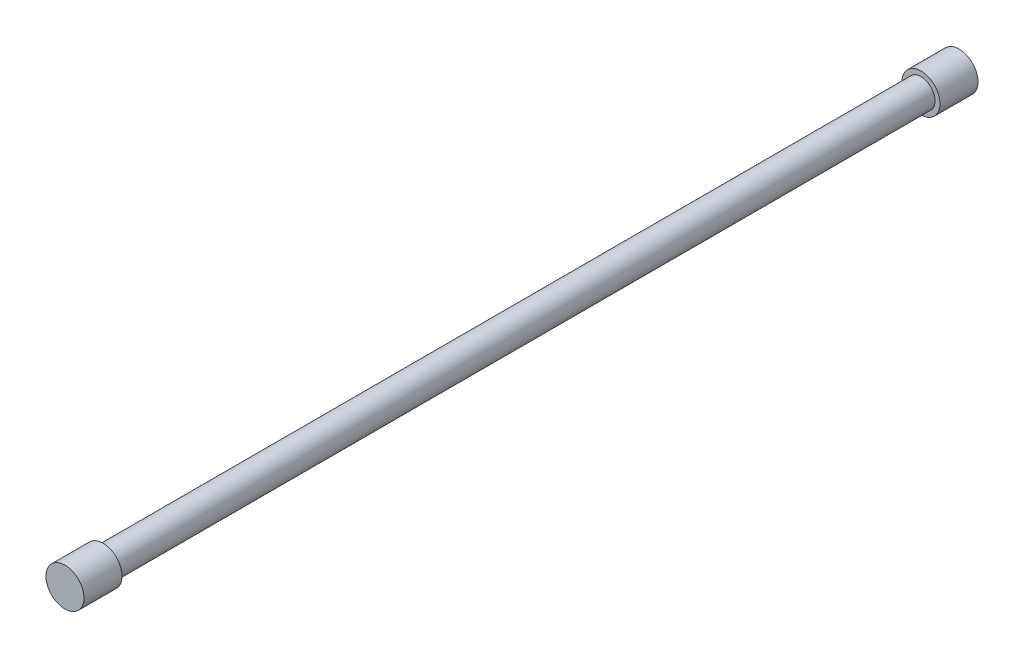
ISO-10303-21;
HEADER;
FILE_DESCRIPTION(('STEP AP214'),'2;1');
FILE_NAME('part.step','',(''),(''),'','','');
FILE_SCHEMA(('AUTOMOTIVE_DESIGN { 1 0 10303 214 1 1 1 1 }'));
ENDSEC;
DATA;
#1=APPLICATION_CONTEXT('core data for automotive mechanical design processes');
#2=APPLICATION_PROTOCOL_DEFINITION('international standard','automotive_design',2000,#1);
#3=PRODUCT_CONTEXT('',#1,'mechanical');
#4=PRODUCT('Part','Part','',(#3));
#5=PRODUCT_RELATED_PRODUCT_CATEGORY('part','',(#4));
#6=PRODUCT_DEFINITION_FORMATION('','',#4);
#7=PRODUCT_DEFINITION_CONTEXT('part definition',#1,'design');
#8=PRODUCT_DEFINITION('design','',#6,#7);
#9=PRODUCT_DEFINITION_SHAPE('','',#8);
#10=(LENGTH_UNIT() NAMED_UNIT(*) SI_UNIT(.MILLI.,.METRE.));
#11=(NAMED_UNIT(*) PLANE_ANGLE_UNIT() SI_UNIT($,.RADIAN.));
#12=(NAMED_UNIT(*) SI_UNIT($,.STERADIAN.) SOLID_ANGLE_UNIT());
#13=UNCERTAINTY_MEASURE_WITH_UNIT(LENGTH_MEASURE(1.E-05),#10,'distance_accuracy_value','');
#14=(GEOMETRIC_REPRESENTATION_CONTEXT(3) GLOBAL_UNCERTAINTY_ASSIGNED_CONTEXT((#13)) GLOBAL_UNIT_ASSIGNED_CONTEXT((#10,
#11,#12)) REPRESENTATION_CONTEXT('',''));
#15=CARTESIAN_POINT('',(0.,0.,0.));
#16=DIRECTION('',(0.,0.,1.));
#17=DIRECTION('',(1.,0.,0.));
#18=AXIS2_PLACEMENT_3D('',#15,#16,#17);
#19=CARTESIAN_POINT('',(0.,0.,-430.));
#20=DIRECTION('',(0.,0.,1.));
#21=DIRECTION('',(1.,0.,0.));
#22=AXIS2_PLACEMENT_3D('',#19,#20,#21);
#23=CYLINDRICAL_SURFACE('',#22,7.41);
#24=CARTESIAN_POINT('',(0.,0.,-430.));
#25=DIRECTION('',(0.,0.,-1.));
#26=DIRECTION('',(-1.,0.,0.));
#27=AXIS2_PLACEMENT_3D('',#24,#25,#26);
#28=CIRCLE('',#27,7.41);
#29=CARTESIAN_POINT('',(-7.41,0.,-430.));
#30=VERTEX_POINT('',#29);
#31=EDGE_CURVE('E39',#30,#30,#28,.F.);
#32=ORIENTED_EDGE('',*,*,#31,.T.);
#33=EDGE_LOOP('',(#32));
#34=FACE_BOUND('',#33,.T.);
#35=CARTESIAN_POINT('',(0.,0.,0.));
#36=DIRECTION('',(0.,0.,1.));
#37=DIRECTION('',(1.,0.,0.));
#38=AXIS2_PLACEMENT_3D('',#35,#36,#37);
#39=CIRCLE('',#38,7.41);
#40=CARTESIAN_POINT('',(7.41,0.,0.));
#41=VERTEX_POINT('',#40);
#42=EDGE_CURVE('E10',#41,#41,#39,.T.);
#43=ORIENTED_EDGE('',*,*,#42,.F.);
#44=EDGE_LOOP('',(#43));
#45=FACE_BOUND('',#44,.T.);
#46=ADVANCED_FACE('F33',(#34,#45),#23,.T.);
#47=CARTESIAN_POINT('',(0.,0.,-450.));
#48=DIRECTION('',(0.,0.,1.));
#49=DIRECTION('',(1.,0.,0.));
#50=AXIS2_PLACEMENT_3D('',#47,#48,#49);
#51=CYLINDRICAL_SURFACE('',#50,10.);
#52=CARTESIAN_POINT('',(0.,0.,-450.));
#53=DIRECTION('',(0.,0.,-1.));
#54=DIRECTION('',(-1.,0.,0.));
#55=AXIS2_PLACEMENT_3D('',#52,#53,#54);
#56=CIRCLE('',#55,10.);
#57=CARTESIAN_POINT('',(-10.,0.,-450.));
#58=VERTEX_POINT('',#57);
#59=EDGE_CURVE('E43',#58,#58,#56,.T.);
#60=ORIENTED_EDGE('',*,*,#59,.F.);
#61=EDGE_LOOP('',(#60));
#62=FACE_BOUND('',#61,.T.);
#63=CARTESIAN_POINT('',(0.,0.,-430.));
#64=DIRECTION('',(0.,0.,-1.));
#65=DIRECTION('',(-1.,0.,0.));
#66=AXIS2_PLACEMENT_3D('',#63,#64,#65);
#67=CIRCLE('',#66,10.);
#68=CARTESIAN_POINT('',(-10.,0.,-430.));
#69=VERTEX_POINT('',#68);
#70=EDGE_CURVE('E47',#69,#69,#67,.T.);
#71=ORIENTED_EDGE('',*,*,#70,.T.);
#72=EDGE_LOOP('',(#71));
#73=FACE_BOUND('',#72,.T.);
#74=ADVANCED_FACE('F76',(#62,#73),#51,.T.);
#75=CARTESIAN_POINT('',(0.,0.,-450.));
#76=DIRECTION('',(0.,0.,-1.));
#77=DIRECTION('',(-1.,0.,0.));
#78=AXIS2_PLACEMENT_3D('',#75,#76,#77);
#79=PLANE('',#78);
#80=ORIENTED_EDGE('',*,*,#59,.T.);
#81=EDGE_LOOP('',(#80));
#82=FACE_BOUND('',#81,.T.);
#83=ADVANCED_FACE('F80',(#82),#79,.T.);
#84=CARTESIAN_POINT('',(0.,0.,-430.));
#85=DIRECTION('',(0.,0.,-1.));
#86=DIRECTION('',(-1.,0.,0.));
#87=AXIS2_PLACEMENT_3D('',#84,#85,#86);
#88=PLANE('',#87);
#89=ORIENTED_EDGE('',*,*,#31,.F.);
#90=EDGE_LOOP('',(#89));
#91=FACE_BOUND('',#90,.T.);
#92=ORIENTED_EDGE('',*,*,#70,.F.);
#93=EDGE_LOOP('',(#92));
#94=FACE_BOUND('',#93,.T.);
#95=ADVANCED_FACE('F64',(#91,#94),#88,.F.);
#96=CARTESIAN_POINT('',(0.,0.,20.));
#97=DIRECTION('',(0.,0.,-1.));
#98=DIRECTION('',(-1.,0.,0.));
#99=AXIS2_PLACEMENT_3D('',#96,#97,#98);
#100=CYLINDRICAL_SURFACE('',#99,10.);
#101=CARTESIAN_POINT('',(0.,0.,20.));
#102=DIRECTION('',(0.,0.,1.));
#103=DIRECTION('',(1.,0.,0.));
#104=AXIS2_PLACEMENT_3D('',#101,#102,#103);
#105=CIRCLE('',#104,10.);
#106=CARTESIAN_POINT('',(10.,0.,20.));
#107=VERTEX_POINT('',#106);
#108=EDGE_CURVE('E51',#107,#107,#105,.T.);
#109=ORIENTED_EDGE('',*,*,#108,.F.);
#110=EDGE_LOOP('',(#109));
#111=FACE_BOUND('',#110,.T.);
#112=CARTESIAN_POINT('',(0.,0.,0.));
#113=DIRECTION('',(0.,0.,1.));
#114=DIRECTION('',(1.,0.,0.));
#115=AXIS2_PLACEMENT_3D('',#112,#113,#114);
#116=CIRCLE('',#115,10.);
#117=CARTESIAN_POINT('',(10.,0.,0.));
#118=VERTEX_POINT('',#117);
#119=EDGE_CURVE('E53',#118,#118,#116,.T.);
#120=ORIENTED_EDGE('',*,*,#119,.T.);
#121=EDGE_LOOP('',(#120));
#122=FACE_BOUND('',#121,.T.);
#123=ADVANCED_FACE('F61',(#111,#122),#100,.T.);
#124=CARTESIAN_POINT('',(0.,0.,20.));
#125=DIRECTION('',(0.,0.,1.));
#126=DIRECTION('',(1.,0.,0.));
#127=AXIS2_PLACEMENT_3D('',#124,#125,#126);
#128=PLANE('',#127);
#129=ORIENTED_EDGE('',*,*,#108,.T.);
#130=EDGE_LOOP('',(#129));
#131=FACE_BOUND('',#130,.T.);
#132=ADVANCED_FACE('F59',(#131),#128,.T.);
#133=CARTESIAN_POINT('',(0.,0.,0.));
#134=DIRECTION('',(0.,0.,1.));
#135=DIRECTION('',(1.,0.,0.));
#136=AXIS2_PLACEMENT_3D('',#133,#134,#135);
#137=PLANE('',#136);
#138=ORIENTED_EDGE('',*,*,#42,.T.);
#139=EDGE_LOOP('',(#138));
#140=FACE_BOUND('',#139,.T.);
#141=ORIENTED_EDGE('',*,*,#119,.F.);
#142=EDGE_LOOP('',(#141));
#143=FACE_BOUND('',#142,.T.);
#144=ADVANCED_FACE('F68',(#140,#143),#137,.F.);
#145=CLOSED_SHELL('',(#46,#74,#83,#95,#123,#132,#144));
#146=MANIFOLD_SOLID_BREP('B2',#145);
#147=ADVANCED_BREP_SHAPE_REPRESENTATION('',(#18,#146),#14);
#148=SHAPE_DEFINITION_REPRESENTATION(#9,#147);
ENDSEC;
END-ISO-10303-21;
